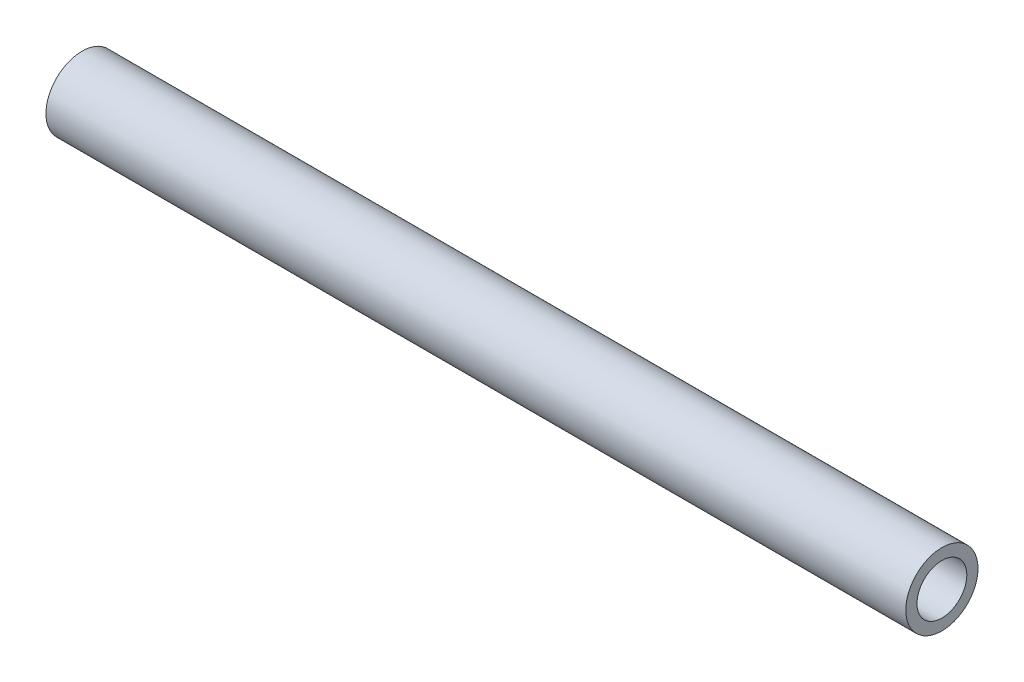
ISO-10303-21;
HEADER;
FILE_DESCRIPTION(('STEP AP214'),'2;1');
FILE_NAME('part.step','',(''),(''),'','','');
FILE_SCHEMA(('AUTOMOTIVE_DESIGN { 1 0 10303 214 1 1 1 1 }'));
ENDSEC;
DATA;
#1=APPLICATION_CONTEXT('core data for automotive mechanical design processes');
#2=APPLICATION_PROTOCOL_DEFINITION('international standard','automotive_design',2000,#1);
#3=PRODUCT_CONTEXT('',#1,'mechanical');
#4=PRODUCT('Part','Part','',(#3));
#5=PRODUCT_RELATED_PRODUCT_CATEGORY('part','',(#4));
#6=PRODUCT_DEFINITION_FORMATION('','',#4);
#7=PRODUCT_DEFINITION_CONTEXT('part definition',#1,'design');
#8=PRODUCT_DEFINITION('design','',#6,#7);
#9=PRODUCT_DEFINITION_SHAPE('','',#8);
#10=(LENGTH_UNIT() NAMED_UNIT(*) SI_UNIT(.MILLI.,.METRE.));
#11=(NAMED_UNIT(*) PLANE_ANGLE_UNIT() SI_UNIT($,.RADIAN.));
#12=(NAMED_UNIT(*) SI_UNIT($,.STERADIAN.) SOLID_ANGLE_UNIT());
#13=UNCERTAINTY_MEASURE_WITH_UNIT(LENGTH_MEASURE(1.E-05),#10,'distance_accuracy_value','');
#14=(GEOMETRIC_REPRESENTATION_CONTEXT(3) GLOBAL_UNCERTAINTY_ASSIGNED_CONTEXT((#13)) GLOBAL_UNIT_ASSIGNED_CONTEXT((#10,
#11,#12)) REPRESENTATION_CONTEXT('',''));
#15=CARTESIAN_POINT('',(0.,0.,0.));
#16=DIRECTION('',(0.,0.,1.));
#17=DIRECTION('',(1.,0.,0.));
#18=AXIS2_PLACEMENT_3D('',#15,#16,#17);
#19=CARTESIAN_POINT('',(-254.,0.,0.));
#20=DIRECTION('',(1.,0.,0.));
#21=DIRECTION('',(0.,0.,-1.));
#22=AXIS2_PLACEMENT_3D('',#19,#20,#21);
#23=CYLINDRICAL_SURFACE('',#22,10.668);
#24=CARTESIAN_POINT('',(-254.,0.,0.));
#25=DIRECTION('',(1.,0.,0.));
#26=DIRECTION('',(0.,0.,-1.));
#27=AXIS2_PLACEMENT_3D('',#24,#25,#26);
#28=CIRCLE('',#27,10.668);
#29=CARTESIAN_POINT('',(-254.,0.,-10.668));
#30=VERTEX_POINT('',#29);
#31=EDGE_CURVE('E10',#30,#30,#28,.T.);
#32=ORIENTED_EDGE('',*,*,#31,.T.);
#33=EDGE_LOOP('',(#32));
#34=FACE_BOUND('',#33,.T.);
#35=CARTESIAN_POINT('',(0.,0.,0.));
#36=DIRECTION('',(1.,0.,0.));
#37=DIRECTION('',(0.,0.,-1.));
#38=AXIS2_PLACEMENT_3D('',#35,#36,#37);
#39=CIRCLE('',#38,10.668);
#40=CARTESIAN_POINT('',(0.,0.,-10.668));
#41=VERTEX_POINT('',#40);
#42=EDGE_CURVE('E36',#41,#41,#39,.T.);
#43=ORIENTED_EDGE('',*,*,#42,.F.);
#44=EDGE_LOOP('',(#43));
#45=FACE_BOUND('',#44,.T.);
#46=ADVANCED_FACE('F33',(#34,#45),#23,.T.);
#47=CARTESIAN_POINT('',(-254.,0.,0.));
#48=DIRECTION('',(1.,0.,0.));
#49=DIRECTION('',(0.,0.,-1.));
#50=AXIS2_PLACEMENT_3D('',#47,#48,#49);
#51=PLANE('',#50);
#52=CARTESIAN_POINT('',(-254.,0.,0.));
#53=DIRECTION('',(1.,0.,0.));
#54=DIRECTION('',(0.,0.,-1.));
#55=AXIS2_PLACEMENT_3D('',#52,#53,#54);
#56=CIRCLE('',#55,7.366);
#57=CARTESIAN_POINT('',(-254.,0.,-7.366));
#58=VERTEX_POINT('',#57);
#59=EDGE_CURVE('E43',#58,#58,#56,.T.);
#60=ORIENTED_EDGE('',*,*,#59,.T.);
#61=EDGE_LOOP('',(#60));
#62=FACE_BOUND('',#61,.T.);
#63=ORIENTED_EDGE('',*,*,#31,.F.);
#64=EDGE_LOOP('',(#63));
#65=FACE_BOUND('',#64,.T.);
#66=ADVANCED_FACE('F51',(#62,#65),#51,.F.);
#67=CARTESIAN_POINT('',(0.,0.,0.));
#68=DIRECTION('',(1.,0.,0.));
#69=DIRECTION('',(0.,0.,-1.));
#70=AXIS2_PLACEMENT_3D('',#67,#68,#69);
#71=PLANE('',#70);
#72=CARTESIAN_POINT('',(0.,0.,0.));
#73=DIRECTION('',(1.,0.,0.));
#74=DIRECTION('',(0.,0.,-1.));
#75=AXIS2_PLACEMENT_3D('',#72,#73,#74);
#76=CIRCLE('',#75,7.366);
#77=CARTESIAN_POINT('',(0.,0.,-7.366));
#78=VERTEX_POINT('',#77);
#79=EDGE_CURVE('E45',#78,#78,#76,.T.);
#80=ORIENTED_EDGE('',*,*,#79,.F.);
#81=EDGE_LOOP('',(#80));
#82=FACE_BOUND('',#81,.T.);
#83=ORIENTED_EDGE('',*,*,#42,.T.);
#84=EDGE_LOOP('',(#83));
#85=FACE_BOUND('',#84,.T.);
#86=ADVANCED_FACE('F57',(#82,#85),#71,.T.);
#87=CARTESIAN_POINT('',(-254.,0.,0.));
#88=DIRECTION('',(1.,0.,0.));
#89=DIRECTION('',(0.,0.,-1.));
#90=AXIS2_PLACEMENT_3D('',#87,#88,#89);
#91=CYLINDRICAL_SURFACE('',#90,7.366);
#92=ORIENTED_EDGE('',*,*,#59,.F.);
#93=EDGE_LOOP('',(#92));
#94=FACE_BOUND('',#93,.T.);
#95=ORIENTED_EDGE('',*,*,#79,.T.);
#96=EDGE_LOOP('',(#95));
#97=FACE_BOUND('',#96,.T.);
#98=ADVANCED_FACE('F54',(#94,#97),#91,.F.);
#99=CLOSED_SHELL('',(#46,#66,#86,#98));
#100=MANIFOLD_SOLID_BREP('B2',#99);
#101=ADVANCED_BREP_SHAPE_REPRESENTATION('',(#18,#100),#14);
#102=SHAPE_DEFINITION_REPRESENTATION(#9,#101);
ENDSEC;
END-ISO-10303-21;
